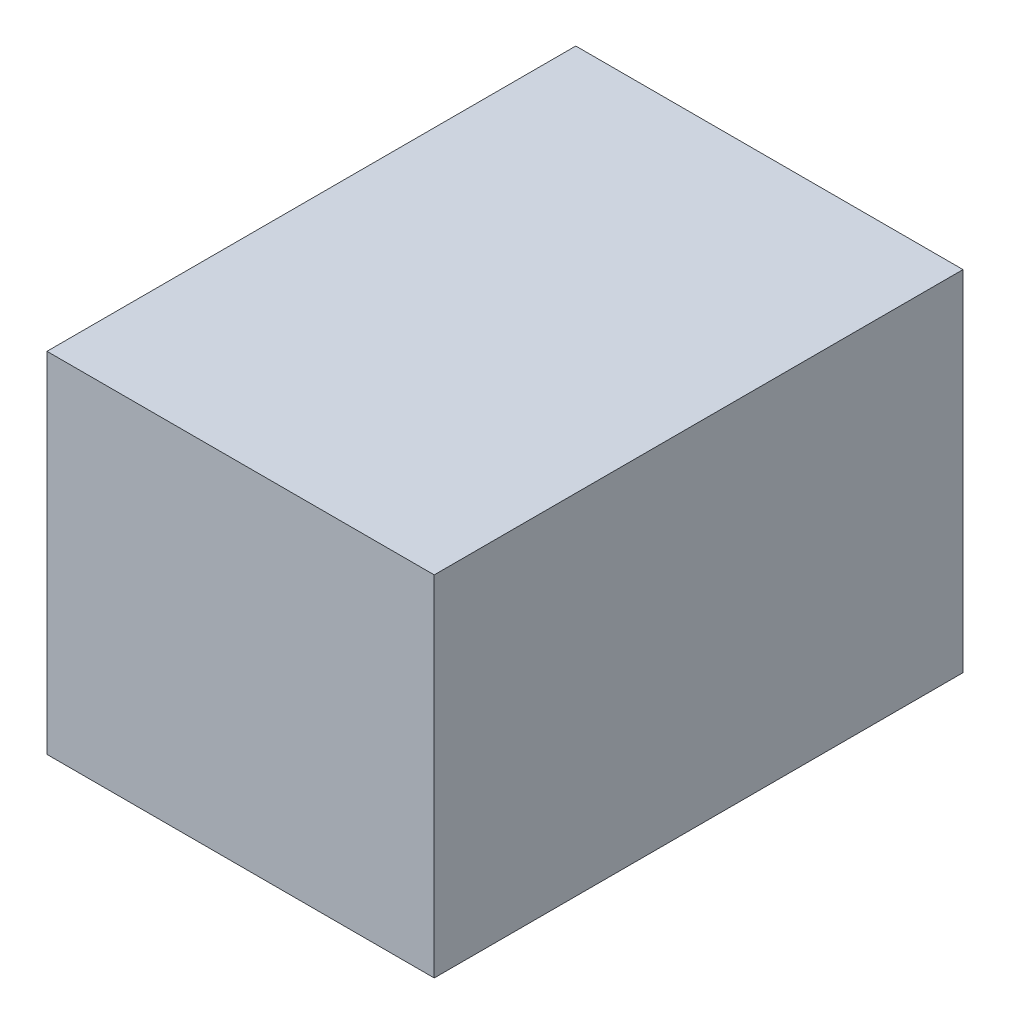
ISO-10303-21;
HEADER;
FILE_DESCRIPTION(('STEP AP214'),'2;1');
FILE_NAME('part.step','',(''),(''),'','','');
FILE_SCHEMA(('AUTOMOTIVE_DESIGN { 1 0 10303 214 1 1 1 1 }'));
ENDSEC;
DATA;
#1=APPLICATION_CONTEXT('core data for automotive mechanical design processes');
#2=APPLICATION_PROTOCOL_DEFINITION('international standard','automotive_design',2000,#1);
#3=PRODUCT_CONTEXT('',#1,'mechanical');
#4=PRODUCT('Part','Part','',(#3));
#5=PRODUCT_RELATED_PRODUCT_CATEGORY('part','',(#4));
#6=PRODUCT_DEFINITION_FORMATION('','',#4);
#7=PRODUCT_DEFINITION_CONTEXT('part definition',#1,'design');
#8=PRODUCT_DEFINITION('design','',#6,#7);
#9=PRODUCT_DEFINITION_SHAPE('','',#8);
#10=(LENGTH_UNIT() NAMED_UNIT(*) SI_UNIT(.MILLI.,.METRE.));
#11=(NAMED_UNIT(*) PLANE_ANGLE_UNIT() SI_UNIT($,.RADIAN.));
#12=(NAMED_UNIT(*) SI_UNIT($,.STERADIAN.) SOLID_ANGLE_UNIT());
#13=UNCERTAINTY_MEASURE_WITH_UNIT(LENGTH_MEASURE(1.E-05),#10,'distance_accuracy_value','');
#14=(GEOMETRIC_REPRESENTATION_CONTEXT(3) GLOBAL_UNCERTAINTY_ASSIGNED_CONTEXT((#13)) GLOBAL_UNIT_ASSIGNED_CONTEXT((#10,
#11,#12)) REPRESENTATION_CONTEXT('',''));
#15=CARTESIAN_POINT('',(0.,0.,0.));
#16=DIRECTION('',(0.,0.,1.));
#17=DIRECTION('',(1.,0.,0.));
#18=AXIS2_PLACEMENT_3D('',#15,#16,#17);
#19=CARTESIAN_POINT('',(0.,10.9,0.));
#20=DIRECTION('',(1.,0.,0.));
#21=DIRECTION('',(0.,0.,-1.));
#22=AXIS2_PLACEMENT_3D('',#19,#20,#21);
#23=PLANE('',#22);
#24=DIRECTION('',(0.,0.,1.));
#25=VECTOR('',#24,1.);
#26=CARTESIAN_POINT('',(0.,0.,0.));
#27=LINE('',#26,#25);
#28=CARTESIAN_POINT('',(0.,0.,-16.51));
#29=VERTEX_POINT('',#28);
#30=CARTESIAN_POINT('',(0.,0.,0.));
#31=VERTEX_POINT('',#30);
#32=EDGE_CURVE('E98',#29,#31,#27,.T.);
#33=ORIENTED_EDGE('',*,*,#32,.T.);
#34=DIRECTION('',(0.,-1.,0.));
#35=VECTOR('',#34,1.);
#36=CARTESIAN_POINT('',(0.,10.9,0.));
#37=LINE('',#36,#35);
#38=CARTESIAN_POINT('',(0.,10.9,0.));
#39=VERTEX_POINT('',#38);
#40=EDGE_CURVE('E11',#39,#31,#37,.T.);
#41=ORIENTED_EDGE('',*,*,#40,.F.);
#42=DIRECTION('',(0.,0.,1.));
#43=VECTOR('',#42,1.);
#44=CARTESIAN_POINT('',(0.,10.9,0.));
#45=LINE('',#44,#43);
#46=CARTESIAN_POINT('',(0.,10.9,-16.51));
#47=VERTEX_POINT('',#46);
#48=EDGE_CURVE('E86',#47,#39,#45,.T.);
#49=ORIENTED_EDGE('',*,*,#48,.F.);
#50=DIRECTION('',(0.,-1.,0.));
#51=VECTOR('',#50,1.);
#52=CARTESIAN_POINT('',(0.,10.9,-16.51));
#53=LINE('',#52,#51);
#54=EDGE_CURVE('E94',#47,#29,#53,.T.);
#55=ORIENTED_EDGE('',*,*,#54,.T.);
#56=EDGE_LOOP('',(#33,#41,#49,#55));
#57=FACE_BOUND('',#56,.T.);
#58=ADVANCED_FACE('F35',(#57),#23,.F.);
#59=CARTESIAN_POINT('',(0.,10.9,0.));
#60=DIRECTION('',(0.,0.,-1.));
#61=DIRECTION('',(-1.,0.,0.));
#62=AXIS2_PLACEMENT_3D('',#59,#60,#61);
#63=PLANE('',#62);
#64=DIRECTION('',(1.,0.,0.));
#65=VECTOR('',#64,1.);
#66=CARTESIAN_POINT('',(0.,0.,0.));
#67=LINE('',#66,#65);
#68=CARTESIAN_POINT('',(12.0904,0.,0.));
#69=VERTEX_POINT('',#68);
#70=EDGE_CURVE('E90',#31,#69,#67,.T.);
#71=ORIENTED_EDGE('',*,*,#70,.T.);
#72=DIRECTION('',(0.,-1.,0.));
#73=VECTOR('',#72,1.);
#74=CARTESIAN_POINT('',(12.0904,10.9,0.));
#75=LINE('',#74,#73);
#76=CARTESIAN_POINT('',(12.0904,10.9,0.));
#77=VERTEX_POINT('',#76);
#78=EDGE_CURVE('E43',#77,#69,#75,.T.);
#79=ORIENTED_EDGE('',*,*,#78,.F.);
#80=DIRECTION('',(1.,0.,0.));
#81=VECTOR('',#80,1.);
#82=CARTESIAN_POINT('',(0.,10.9,0.));
#83=LINE('',#82,#81);
#84=EDGE_CURVE('E81',#39,#77,#83,.T.);
#85=ORIENTED_EDGE('',*,*,#84,.F.);
#86=ORIENTED_EDGE('',*,*,#40,.T.);
#87=EDGE_LOOP('',(#71,#79,#85,#86));
#88=FACE_BOUND('',#87,.T.);
#89=ADVANCED_FACE('F89',(#88),#63,.F.);
#90=CARTESIAN_POINT('',(12.0904,10.9,0.));
#91=DIRECTION('',(-1.,0.,0.));
#92=DIRECTION('',(0.,0.,1.));
#93=AXIS2_PLACEMENT_3D('',#90,#91,#92);
#94=PLANE('',#93);
#95=DIRECTION('',(0.,0.,-1.));
#96=VECTOR('',#95,1.);
#97=CARTESIAN_POINT('',(12.0904,0.,0.));
#98=LINE('',#97,#96);
#99=CARTESIAN_POINT('',(12.0904,0.,-16.51));
#100=VERTEX_POINT('',#99);
#101=EDGE_CURVE('E68',#69,#100,#98,.T.);
#102=ORIENTED_EDGE('',*,*,#101,.T.);
#103=DIRECTION('',(0.,-1.,0.));
#104=VECTOR('',#103,1.);
#105=CARTESIAN_POINT('',(12.0904,10.9,-16.51));
#106=LINE('',#105,#104);
#107=CARTESIAN_POINT('',(12.0904,10.9,-16.51));
#108=VERTEX_POINT('',#107);
#109=EDGE_CURVE('E91',#108,#100,#106,.T.);
#110=ORIENTED_EDGE('',*,*,#109,.F.);
#111=DIRECTION('',(0.,0.,-1.));
#112=VECTOR('',#111,1.);
#113=CARTESIAN_POINT('',(12.0904,10.9,0.));
#114=LINE('',#113,#112);
#115=EDGE_CURVE('E84',#77,#108,#114,.T.);
#116=ORIENTED_EDGE('',*,*,#115,.F.);
#117=ORIENTED_EDGE('',*,*,#78,.T.);
#118=EDGE_LOOP('',(#102,#110,#116,#117));
#119=FACE_BOUND('',#118,.T.);
#120=ADVANCED_FACE('F92',(#119),#94,.F.);
#121=CARTESIAN_POINT('',(0.,10.9,-16.51));
#122=DIRECTION('',(0.,0.,1.));
#123=DIRECTION('',(1.,0.,0.));
#124=AXIS2_PLACEMENT_3D('',#121,#122,#123);
#125=PLANE('',#124);
#126=DIRECTION('',(-1.,0.,0.));
#127=VECTOR('',#126,1.);
#128=CARTESIAN_POINT('',(0.,0.,-16.51));
#129=LINE('',#128,#127);
#130=EDGE_CURVE('E74',#100,#29,#129,.T.);
#131=ORIENTED_EDGE('',*,*,#130,.T.);
#132=ORIENTED_EDGE('',*,*,#54,.F.);
#133=DIRECTION('',(-1.,0.,0.));
#134=VECTOR('',#133,1.);
#135=CARTESIAN_POINT('',(0.,10.9,-16.51));
#136=LINE('',#135,#134);
#137=EDGE_CURVE('E51',#108,#47,#136,.T.);
#138=ORIENTED_EDGE('',*,*,#137,.F.);
#139=ORIENTED_EDGE('',*,*,#109,.T.);
#140=EDGE_LOOP('',(#131,#132,#138,#139));
#141=FACE_BOUND('',#140,.T.);
#142=ADVANCED_FACE('F105',(#141),#125,.F.);
#143=CARTESIAN_POINT('',(0.,10.9,0.));
#144=DIRECTION('',(0.,-1.,0.));
#145=DIRECTION('',(0.,0.,-1.));
#146=AXIS2_PLACEMENT_3D('',#143,#144,#145);
#147=PLANE('',#146);
#148=ORIENTED_EDGE('',*,*,#48,.T.);
#149=ORIENTED_EDGE('',*,*,#84,.T.);
#150=ORIENTED_EDGE('',*,*,#115,.T.);
#151=ORIENTED_EDGE('',*,*,#137,.T.);
#152=EDGE_LOOP('',(#148,#149,#150,#151));
#153=FACE_BOUND('',#152,.T.);
#154=ADVANCED_FACE('F82',(#153),#147,.F.);
#155=CARTESIAN_POINT('',(0.,0.,0.));
#156=DIRECTION('',(0.,-1.,0.));
#157=DIRECTION('',(0.,0.,-1.));
#158=AXIS2_PLACEMENT_3D('',#155,#156,#157);
#159=PLANE('',#158);
#160=ORIENTED_EDGE('',*,*,#32,.F.);
#161=ORIENTED_EDGE('',*,*,#130,.F.);
#162=ORIENTED_EDGE('',*,*,#101,.F.);
#163=ORIENTED_EDGE('',*,*,#70,.F.);
#164=EDGE_LOOP('',(#160,#161,#162,#163));
#165=FACE_BOUND('',#164,.T.);
#166=ADVANCED_FACE('F108',(#165),#159,.T.);
#167=CLOSED_SHELL('',(#58,#89,#120,#142,#154,#166));
#168=MANIFOLD_SOLID_BREP('B2',#167);
#169=ADVANCED_BREP_SHAPE_REPRESENTATION('',(#18,#168),#14);
#170=SHAPE_DEFINITION_REPRESENTATION(#9,#169);
ENDSEC;
END-ISO-10303-21;
